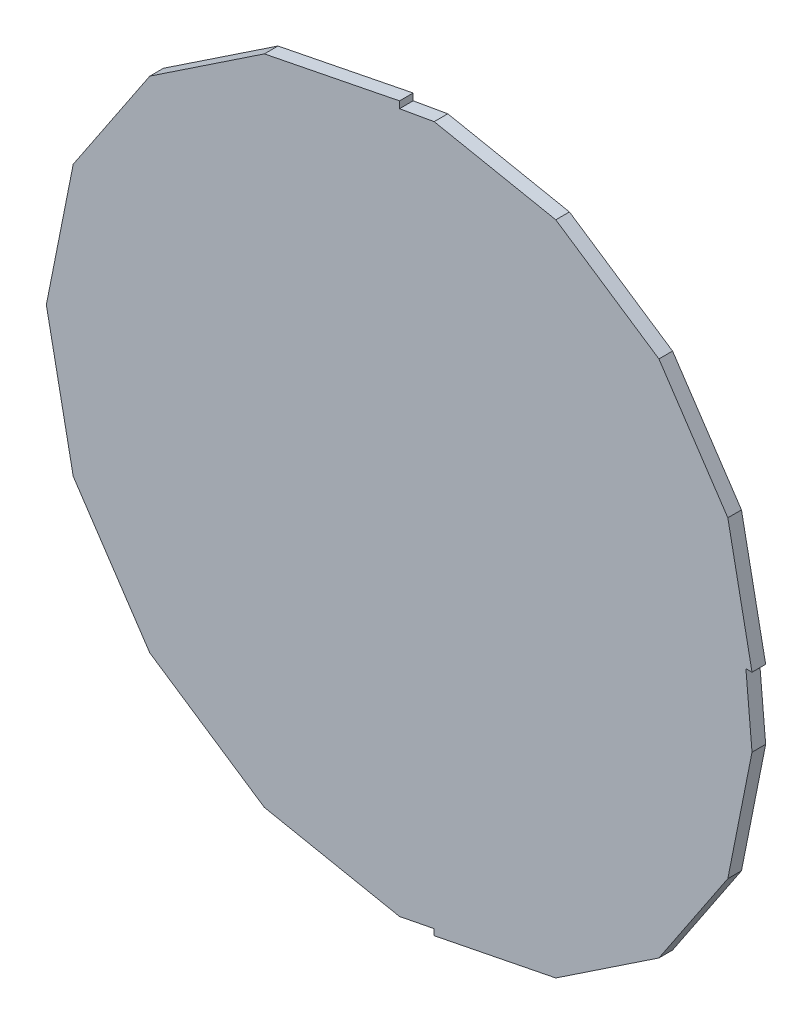
ISO-10303-21;
HEADER;
FILE_DESCRIPTION(('STEP AP214'),'2;1');
FILE_NAME('part.step','',(''),(''),'','','');
FILE_SCHEMA(('AUTOMOTIVE_DESIGN { 1 0 10303 214 1 1 1 1 }'));
ENDSEC;
DATA;
#1=APPLICATION_CONTEXT('core data for automotive mechanical design processes');
#2=APPLICATION_PROTOCOL_DEFINITION('international standard','automotive_design',2000,#1);
#3=PRODUCT_CONTEXT('',#1,'mechanical');
#4=PRODUCT('Part','Part','',(#3));
#5=PRODUCT_RELATED_PRODUCT_CATEGORY('part','',(#4));
#6=PRODUCT_DEFINITION_FORMATION('','',#4);
#7=PRODUCT_DEFINITION_CONTEXT('part definition',#1,'design');
#8=PRODUCT_DEFINITION('design','',#6,#7);
#9=PRODUCT_DEFINITION_SHAPE('','',#8);
#10=(LENGTH_UNIT() NAMED_UNIT(*) SI_UNIT(.MILLI.,.METRE.));
#11=(NAMED_UNIT(*) PLANE_ANGLE_UNIT() SI_UNIT($,.RADIAN.));
#12=(NAMED_UNIT(*) SI_UNIT($,.STERADIAN.) SOLID_ANGLE_UNIT());
#13=UNCERTAINTY_MEASURE_WITH_UNIT(LENGTH_MEASURE(1.E-05),#10,'distance_accuracy_value','');
#14=(GEOMETRIC_REPRESENTATION_CONTEXT(3) GLOBAL_UNCERTAINTY_ASSIGNED_CONTEXT((#13)) GLOBAL_UNIT_ASSIGNED_CONTEXT((#10,
#11,#12)) REPRESENTATION_CONTEXT('',''));
#15=CARTESIAN_POINT('',(0.,0.,0.));
#16=DIRECTION('',(0.,0.,1.));
#17=DIRECTION('',(1.,0.,0.));
#18=AXIS2_PLACEMENT_3D('',#15,#16,#17);
#19=CARTESIAN_POINT('',(0.02564892000001,0.25847802,0.00999998));
#20=DIRECTION('',(0.,0.,1.));
#21=DIRECTION('',(1.,0.,0.));
#22=AXIS2_PLACEMENT_3D('',#19,#20,#21);
#23=PLANE('',#22);
#24=DIRECTION('',(-0.831465458552138,0.555576449496092,0.));
#25=VECTOR('',#24,1.);
#26=CARTESIAN_POINT('',(0.11484356,0.24073612,0.00999998));
#27=LINE('',#26,#25);
#28=CARTESIAN_POINT('',(0.114843559999999,0.240736119999997,0.00999998));
#29=VERTEX_POINT('',#28);
#30=CARTESIAN_POINT('',(0.190459360000007,0.190210440000011,0.00999998));
#31=VERTEX_POINT('',#30);
#32=EDGE_CURVE('E257',#29,#31,#27,.F.);
#33=ORIENTED_EDGE('',*,*,#32,.F.);
#34=DIRECTION('',(-0.980785316171062,0.195090142199012,0.));
#35=VECTOR('',#34,1.);
#36=CARTESIAN_POINT('',(0.02564892000001,0.25847802,0.00999998));
#37=LINE('',#36,#35);
#38=CARTESIAN_POINT('',(0.0256489200000114,0.258478019999992,0.00999998));
#39=VERTEX_POINT('',#38);
#40=EDGE_CURVE('E178',#39,#29,#37,.F.);
#41=ORIENTED_EDGE('',*,*,#40,.F.);
#42=DIRECTION('',(-0.984812296572393,-0.173622407885069,0.));
#43=VECTOR('',#42,1.);
#44=CARTESIAN_POINT('',(0.0002489200000042,0.254,0.00999998));
#45=LINE('',#44,#43);
#46=CARTESIAN_POINT('',(0.0002489200000042,0.254,0.00999998));
#47=VERTEX_POINT('',#46);
#48=EDGE_CURVE('E20',#47,#39,#45,.F.);
#49=ORIENTED_EDGE('',*,*,#48,.F.);
#50=DIRECTION('',(0.,1.,0.));
#51=VECTOR('',#50,1.);
#52=CARTESIAN_POINT('',(0.0002489200000042,0.25897586,0.00999998));
#53=LINE('',#52,#51);
#54=CARTESIAN_POINT('',(0.000248920000002501,0.258975860000009,0.00999998));
#55=VERTEX_POINT('',#54);
#56=EDGE_CURVE('E167',#55,#47,#53,.F.);
#57=ORIENTED_EDGE('',*,*,#56,.F.);
#58=DIRECTION('',(-0.980786063177685,-0.195086386701937,0.));
#59=VECTOR('',#58,1.);
#60=CARTESIAN_POINT('',(-0.09885679999999,0.23926292,0.00999998));
#61=LINE('',#60,#59);
#62=CARTESIAN_POINT('',(-0.0988567999999997,0.239262920000015,0.00999998));
#63=VERTEX_POINT('',#62);
#64=EDGE_CURVE('E162',#63,#55,#61,.F.);
#65=ORIENTED_EDGE('',*,*,#64,.F.);
#66=DIRECTION('',(-0.831469763080059,-0.55557000736504,0.));
#67=VECTOR('',#66,1.);
#68=CARTESIAN_POINT('',(-0.18287492,0.18312384,0.00999998));
#69=LINE('',#68,#67);
#70=CARTESIAN_POINT('',(-0.182874920000017,0.183123840000011,0.00999998));
#71=VERTEX_POINT('',#70);
#72=EDGE_CURVE('E189',#71,#63,#69,.F.);
#73=ORIENTED_EDGE('',*,*,#72,.F.);
#74=DIRECTION('',(-0.555570007363886,-0.83146976308083,0.));
#75=VECTOR('',#74,1.);
#76=CARTESIAN_POINT('',(-0.239014,0.09910572000001,0.00999998));
#77=LINE('',#76,#75);
#78=CARTESIAN_POINT('',(-0.239013999999991,0.0991057200000081,0.00999998));
#79=VERTEX_POINT('',#78);
#80=EDGE_CURVE('E193',#79,#71,#77,.F.);
#81=ORIENTED_EDGE('',*,*,#80,.F.);
#82=DIRECTION('',(-0.195086386701937,-0.980786063177685,0.));
#83=VECTOR('',#82,1.);
#84=CARTESIAN_POINT('',(-0.25872694,0.,0.00999998));
#85=LINE('',#84,#83);
#86=CARTESIAN_POINT('',(-0.258726940000008,0.,0.00999998));
#87=VERTEX_POINT('',#86);
#88=EDGE_CURVE('E197',#87,#79,#85,.F.);
#89=ORIENTED_EDGE('',*,*,#88,.F.);
#90=DIRECTION('',(0.195086386701937,-0.980786063177685,0.));
#91=VECTOR('',#90,1.);
#92=CARTESIAN_POINT('',(-0.239014,-0.09910571999998,0.00999998));
#93=LINE('',#92,#91);
#94=CARTESIAN_POINT('',(-0.239013999999987,-0.099105719999971,0.00999998));
#95=VERTEX_POINT('',#94);
#96=EDGE_CURVE('E201',#95,#87,#93,.F.);
#97=ORIENTED_EDGE('',*,*,#96,.F.);
#98=DIRECTION('',(0.555570007363886,-0.83146976308083,0.));
#99=VECTOR('',#98,1.);
#100=CARTESIAN_POINT('',(-0.18287492,-0.18312384,0.00999998));
#101=LINE('',#100,#99);
#102=CARTESIAN_POINT('',(-0.18287491999999,-0.183123839999986,0.00999998));
#103=VERTEX_POINT('',#102);
#104=EDGE_CURVE('E205',#103,#95,#101,.F.);
#105=ORIENTED_EDGE('',*,*,#104,.F.);
#106=DIRECTION('',(0.831469763080059,-0.55557000736504,0.));
#107=VECTOR('',#106,1.);
#108=CARTESIAN_POINT('',(-0.09885679999999,-0.23926292,0.00999998));
#109=LINE('',#108,#107);
#110=CARTESIAN_POINT('',(-0.0988567999999882,-0.239262919999991,0.00999998));
#111=VERTEX_POINT('',#110);
#112=EDGE_CURVE('E209',#111,#103,#109,.F.);
#113=ORIENTED_EDGE('',*,*,#112,.F.);
#114=DIRECTION('',(0.980786063177685,-0.195086386701937,0.));
#115=VECTOR('',#114,1.);
#116=CARTESIAN_POINT('',(0.0002489200000042,-0.25897586,0.00999998));
#117=LINE('',#116,#115);
#118=CARTESIAN_POINT('',(0.000248920000004808,-0.258975860000003,0.00999998));
#119=VERTEX_POINT('',#118);
#120=EDGE_CURVE('E213',#119,#111,#117,.F.);
#121=ORIENTED_EDGE('',*,*,#120,.F.);
#122=DIRECTION('',(0.981346797966218,0.192245837722043,0.));
#123=VECTOR('',#122,1.);
#124=CARTESIAN_POINT('',(0.02564892000001,-0.254,0.00999998));
#125=LINE('',#124,#123);
#126=CARTESIAN_POINT('',(0.02564892000001,-0.254,0.00999998));
#127=VERTEX_POINT('',#126);
#128=EDGE_CURVE('E217',#127,#119,#125,.F.);
#129=ORIENTED_EDGE('',*,*,#128,.F.);
#130=DIRECTION('',(0.,1.,0.));
#131=VECTOR('',#130,1.);
#132=CARTESIAN_POINT('',(0.02564892000001,-0.25847802,0.00999998));
#133=LINE('',#132,#131);
#134=CARTESIAN_POINT('',(0.0256489200000106,-0.258478020000003,0.00999998));
#135=VERTEX_POINT('',#134);
#136=EDGE_CURVE('E221',#135,#127,#133,.T.);
#137=ORIENTED_EDGE('',*,*,#136,.F.);
#138=DIRECTION('',(0.980785316171062,0.195090142199012,0.));
#139=VECTOR('',#138,1.);
#140=CARTESIAN_POINT('',(0.11484356,-0.24073612,0.00999998));
#141=LINE('',#140,#139);
#142=CARTESIAN_POINT('',(0.114843559999993,-0.240736119999989,0.00999998));
#143=VERTEX_POINT('',#142);
#144=EDGE_CURVE('E225',#143,#135,#141,.F.);
#145=ORIENTED_EDGE('',*,*,#144,.F.);
#146=DIRECTION('',(0.831465458552138,0.555576449496092,0.));
#147=VECTOR('',#146,1.);
#148=CARTESIAN_POINT('',(0.19045936,-0.19021044,0.00999998));
#149=LINE('',#148,#147);
#150=CARTESIAN_POINT('',(0.190459360000011,-0.190210440000007,0.00999998));
#151=VERTEX_POINT('',#150);
#152=EDGE_CURVE('E229',#151,#143,#149,.F.);
#153=ORIENTED_EDGE('',*,*,#152,.F.);
#154=DIRECTION('',(0.555576449496092,0.831465458552138,0.));
#155=VECTOR('',#154,1.);
#156=CARTESIAN_POINT('',(0.24098504,-0.11459464,0.00999998));
#157=LINE('',#156,#155);
#158=CARTESIAN_POINT('',(0.240985039999996,-0.114594639999999,0.00999998));
#159=VERTEX_POINT('',#158);
#160=EDGE_CURVE('E233',#159,#151,#157,.F.);
#161=ORIENTED_EDGE('',*,*,#160,.F.);
#162=DIRECTION('',(0.195090142199012,0.980785316171062,0.));
#163=VECTOR('',#162,1.);
#164=CARTESIAN_POINT('',(0.25872694,-0.02539999999999,0.00999998));
#165=LINE('',#164,#163);
#166=CARTESIAN_POINT('',(0.258726939999998,-0.0253999999999904,0.00999998));
#167=VERTEX_POINT('',#166);
#168=EDGE_CURVE('E237',#167,#159,#165,.F.);
#169=ORIENTED_EDGE('',*,*,#168,.F.);
#170=DIRECTION('',(-0.0878095017098309,0.996137285422783,0.));
#171=VECTOR('',#170,1.);
#172=CARTESIAN_POINT('',(0.25424892,0.02540000000002,0.00999998));
#173=LINE('',#172,#171);
#174=CARTESIAN_POINT('',(0.25424892,0.02540000000002,0.00999998));
#175=VERTEX_POINT('',#174);
#176=EDGE_CURVE('E241',#175,#167,#173,.F.);
#177=ORIENTED_EDGE('',*,*,#176,.F.);
#178=DIRECTION('',(1.,0.,0.));
#179=VECTOR('',#178,1.);
#180=CARTESIAN_POINT('',(0.25872694,0.02540000000002,0.00999998));
#181=LINE('',#180,#179);
#182=CARTESIAN_POINT('',(0.258726940000003,0.0254000000000205,0.00999998));
#183=VERTEX_POINT('',#182);
#184=EDGE_CURVE('E245',#183,#175,#181,.F.);
#185=ORIENTED_EDGE('',*,*,#184,.F.);
#186=DIRECTION('',(-0.195090142199012,0.980785316171062,0.));
#187=VECTOR('',#186,1.);
#188=CARTESIAN_POINT('',(0.24098504,0.11459464,0.00999998));
#189=LINE('',#188,#187);
#190=CARTESIAN_POINT('',(0.240985039999989,0.114594639999993,0.00999998));
#191=VERTEX_POINT('',#190);
#192=EDGE_CURVE('E249',#191,#183,#189,.F.);
#193=ORIENTED_EDGE('',*,*,#192,.F.);
#194=DIRECTION('',(-0.555576449496092,0.831465458552138,0.));
#195=VECTOR('',#194,1.);
#196=CARTESIAN_POINT('',(0.19045936,0.19021044,0.00999998));
#197=LINE('',#196,#195);
#198=EDGE_CURVE('E253',#31,#191,#197,.F.);
#199=ORIENTED_EDGE('',*,*,#198,.F.);
#200=EDGE_LOOP('',(#33,#41,#49,#57,#65,#73,#81,#89,#97,#105,#113,#121,#129,#137,#145,#153,#161,
#169,#177,#185,#193,#199));
#201=FACE_BOUND('',#200,.T.);
#202=ADVANCED_FACE('F17',(#201),#23,.T.);
#203=CARTESIAN_POINT('',(0.0002489200000042,0.254,0.));
#204=DIRECTION('',(-0.173622407885069,0.984812296572393,0.));
#205=DIRECTION('',(-0.984812296572393,-0.173622407885069,0.));
#206=AXIS2_PLACEMENT_3D('',#203,#204,#205);
#207=PLANE('',#206);
#208=DIRECTION('',(0.,0.,1.));
#209=VECTOR('',#208,1.);
#210=CARTESIAN_POINT('',(0.02564892000001,0.25847802,0.));
#211=LINE('',#210,#209);
#212=CARTESIAN_POINT('',(0.0256489200000114,0.258478019999992,0.));
#213=VERTEX_POINT('',#212);
#214=EDGE_CURVE('E261',#213,#39,#211,.T.);
#215=ORIENTED_EDGE('',*,*,#214,.F.);
#216=DIRECTION('',(-0.984812296572289,-0.173622407885655,0.));
#217=VECTOR('',#216,1.);
#218=CARTESIAN_POINT('',(0.02564892000001,0.25847802,0.));
#219=LINE('',#218,#217);
#220=CARTESIAN_POINT('',(0.0002489200000042,0.254,0.));
#221=VERTEX_POINT('',#220);
#222=EDGE_CURVE('E184',#213,#221,#219,.T.);
#223=ORIENTED_EDGE('',*,*,#222,.T.);
#224=DIRECTION('',(0.,0.,-1.));
#225=VECTOR('',#224,1.);
#226=CARTESIAN_POINT('',(0.0002489200000042,0.254,0.));
#227=LINE('',#226,#225);
#228=EDGE_CURVE('E172',#47,#221,#227,.T.);
#229=ORIENTED_EDGE('',*,*,#228,.F.);
#230=ORIENTED_EDGE('',*,*,#48,.T.);
#231=EDGE_LOOP('',(#215,#223,#229,#230));
#232=FACE_BOUND('',#231,.T.);
#233=ADVANCED_FACE('F183',(#232),#207,.T.);
#234=CARTESIAN_POINT('',(0.0002489200000042,0.25897586,0.));
#235=DIRECTION('',(1.,0.,0.));
#236=DIRECTION('',(0.,0.,-1.));
#237=AXIS2_PLACEMENT_3D('',#234,#235,#236);
#238=PLANE('',#237);
#239=ORIENTED_EDGE('',*,*,#228,.T.);
#240=DIRECTION('',(0.,1.,0.));
#241=VECTOR('',#240,1.);
#242=CARTESIAN_POINT('',(0.0002489200000042,0.25847802,0.));
#243=LINE('',#242,#241);
#244=CARTESIAN_POINT('',(0.000248920000002509,0.258975860000009,0.));
#245=VERTEX_POINT('',#244);
#246=EDGE_CURVE('E266',#221,#245,#243,.T.);
#247=ORIENTED_EDGE('',*,*,#246,.T.);
#248=DIRECTION('',(0.,0.,1.));
#249=VECTOR('',#248,1.);
#250=CARTESIAN_POINT('',(0.000248919999997423,0.258975860000034,0.));
#251=LINE('',#250,#249);
#252=EDGE_CURVE('E174',#55,#245,#251,.F.);
#253=ORIENTED_EDGE('',*,*,#252,.F.);
#254=ORIENTED_EDGE('',*,*,#56,.T.);
#255=EDGE_LOOP('',(#239,#247,#253,#254));
#256=FACE_BOUND('',#255,.T.);
#257=ADVANCED_FACE('F169',(#256),#238,.T.);
#258=CARTESIAN_POINT('',(-0.09885679999999,0.23926292,0.));
#259=DIRECTION('',(-0.195086386701937,0.980786063177685,0.));
#260=DIRECTION('',(-0.980786063177685,-0.195086386701937,0.));
#261=AXIS2_PLACEMENT_3D('',#258,#259,#260);
#262=PLANE('',#261);
#263=ORIENTED_EDGE('',*,*,#252,.T.);
#264=DIRECTION('',(-0.980786063177752,-0.195086386701599,0.));
#265=VECTOR('',#264,1.);
#266=CARTESIAN_POINT('',(0.0002489200000042,0.25897586,0.));
#267=LINE('',#266,#265);
#268=CARTESIAN_POINT('',(-0.0988567999999997,0.239262920000015,0.));
#269=VERTEX_POINT('',#268);
#270=EDGE_CURVE('E268',#245,#269,#267,.T.);
#271=ORIENTED_EDGE('',*,*,#270,.T.);
#272=DIRECTION('',(0.,0.,1.));
#273=VECTOR('',#272,1.);
#274=CARTESIAN_POINT('',(-0.0988568000000288,0.239262920000058,0.));
#275=LINE('',#274,#273);
#276=EDGE_CURVE('E191',#63,#269,#275,.F.);
#277=ORIENTED_EDGE('',*,*,#276,.F.);
#278=ORIENTED_EDGE('',*,*,#64,.T.);
#279=EDGE_LOOP('',(#263,#271,#277,#278));
#280=FACE_BOUND('',#279,.T.);
#281=ADVANCED_FACE('F414',(#280),#262,.T.);
#282=CARTESIAN_POINT('',(-0.18287492,0.18312384,0.));
#283=DIRECTION('',(-0.55557000736504,0.831469763080059,0.));
#284=DIRECTION('',(-0.831469763080059,-0.55557000736504,0.));
#285=AXIS2_PLACEMENT_3D('',#282,#283,#284);
#286=PLANE('',#285);
#287=ORIENTED_EDGE('',*,*,#276,.T.);
#288=DIRECTION('',(-0.831469763080443,-0.555570007364465,0.));
#289=VECTOR('',#288,1.);
#290=CARTESIAN_POINT('',(-0.09885679999999,0.23926292,0.));
#291=LINE('',#290,#289);
#292=CARTESIAN_POINT('',(-0.182874920000017,0.183123840000011,0.));
#293=VERTEX_POINT('',#292);
#294=EDGE_CURVE('E271',#269,#293,#291,.T.);
#295=ORIENTED_EDGE('',*,*,#294,.T.);
#296=DIRECTION('',(0.,0.,1.));
#297=VECTOR('',#296,1.);
#298=CARTESIAN_POINT('',(-0.182874920000068,0.183123840000045,0.));
#299=LINE('',#298,#297);
#300=EDGE_CURVE('E195',#71,#293,#299,.F.);
#301=ORIENTED_EDGE('',*,*,#300,.F.);
#302=ORIENTED_EDGE('',*,*,#72,.T.);
#303=EDGE_LOOP('',(#287,#295,#301,#302));
#304=FACE_BOUND('',#303,.T.);
#305=ADVANCED_FACE('F413',(#304),#286,.T.);
#306=CARTESIAN_POINT('',(-0.239014,0.09910572000001,0.));
#307=DIRECTION('',(-0.83146976308083,0.555570007363886,0.));
#308=DIRECTION('',(-0.555570007363886,-0.83146976308083,0.));
#309=AXIS2_PLACEMENT_3D('',#306,#307,#308);
#310=PLANE('',#309);
#311=ORIENTED_EDGE('',*,*,#300,.T.);
#312=DIRECTION('',(-0.555570007364556,-0.831469763080382,0.));
#313=VECTOR('',#312,1.);
#314=CARTESIAN_POINT('',(-0.18287492,0.18312384,0.));
#315=LINE('',#314,#313);
#316=CARTESIAN_POINT('',(-0.239013999999991,0.0991057200000082,0.));
#317=VERTEX_POINT('',#316);
#318=EDGE_CURVE('E274',#293,#317,#315,.T.);
#319=ORIENTED_EDGE('',*,*,#318,.T.);
#320=DIRECTION('',(0.,0.,1.));
#321=VECTOR('',#320,1.);
#322=CARTESIAN_POINT('',(-0.239013999999963,0.0991057200000026,0.));
#323=LINE('',#322,#321);
#324=EDGE_CURVE('E199',#79,#317,#323,.F.);
#325=ORIENTED_EDGE('',*,*,#324,.F.);
#326=ORIENTED_EDGE('',*,*,#80,.T.);
#327=EDGE_LOOP('',(#311,#319,#325,#326));
#328=FACE_BOUND('',#327,.T.);
#329=ADVANCED_FACE('F407',(#328),#310,.T.);
#330=CARTESIAN_POINT('',(-0.25872694,0.,0.));
#331=DIRECTION('',(-0.980786063177685,0.195086386701937,0.));
#332=DIRECTION('',(-0.195086386701937,-0.980786063177685,0.));
#333=AXIS2_PLACEMENT_3D('',#330,#331,#332);
#334=PLANE('',#333);
#335=ORIENTED_EDGE('',*,*,#324,.T.);
#336=DIRECTION('',(-0.195086386701569,-0.980786063177758,0.));
#337=VECTOR('',#336,1.);
#338=CARTESIAN_POINT('',(-0.239014,0.09910572000001,0.));
#339=LINE('',#338,#337);
#340=CARTESIAN_POINT('',(-0.258726940000008,0.,0.));
#341=VERTEX_POINT('',#340);
#342=EDGE_CURVE('E277',#317,#341,#339,.T.);
#343=ORIENTED_EDGE('',*,*,#342,.T.);
#344=DIRECTION('',(0.,0.,1.));
#345=VECTOR('',#344,1.);
#346=CARTESIAN_POINT('',(-0.258726940000031,0.,0.));
#347=LINE('',#346,#345);
#348=EDGE_CURVE('E203',#87,#341,#347,.F.);
#349=ORIENTED_EDGE('',*,*,#348,.F.);
#350=ORIENTED_EDGE('',*,*,#88,.T.);
#351=EDGE_LOOP('',(#335,#343,#349,#350));
#352=FACE_BOUND('',#351,.T.);
#353=ADVANCED_FACE('F403',(#352),#334,.T.);
#354=CARTESIAN_POINT('',(-0.239014,-0.09910571999998,0.));
#355=DIRECTION('',(-0.980786063177685,-0.195086386701937,0.));
#356=DIRECTION('',(0.195086386701937,-0.980786063177685,0.));
#357=AXIS2_PLACEMENT_3D('',#354,#355,#356);
#358=PLANE('',#357);
#359=ORIENTED_EDGE('',*,*,#348,.T.);
#360=DIRECTION('',(0.195086386701626,-0.980786063177747,0.));
#361=VECTOR('',#360,1.);
#362=CARTESIAN_POINT('',(-0.25872694,0.,0.));
#363=LINE('',#362,#361);
#364=CARTESIAN_POINT('',(-0.239013999999987,-0.099105719999971,0.));
#365=VERTEX_POINT('',#364);
#366=EDGE_CURVE('E280',#341,#365,#363,.T.);
#367=ORIENTED_EDGE('',*,*,#366,.T.);
#368=DIRECTION('',(0.,0.,1.));
#369=VECTOR('',#368,1.);
#370=CARTESIAN_POINT('',(-0.239013999999946,-0.099105719999944,0.));
#371=LINE('',#370,#369);
#372=EDGE_CURVE('E207',#95,#365,#371,.F.);
#373=ORIENTED_EDGE('',*,*,#372,.F.);
#374=ORIENTED_EDGE('',*,*,#96,.T.);
#375=EDGE_LOOP('',(#359,#367,#373,#374));
#376=FACE_BOUND('',#375,.T.);
#377=ADVANCED_FACE('F397',(#376),#358,.T.);
#378=CARTESIAN_POINT('',(-0.18287492,-0.18312384,0.));
#379=DIRECTION('',(-0.83146976308083,-0.555570007363886,0.));
#380=DIRECTION('',(0.555570007363886,-0.83146976308083,0.));
#381=AXIS2_PLACEMENT_3D('',#378,#379,#380);
#382=PLANE('',#381);
#383=ORIENTED_EDGE('',*,*,#372,.T.);
#384=DIRECTION('',(0.555570007364419,-0.831469763080474,0.));
#385=VECTOR('',#384,1.);
#386=CARTESIAN_POINT('',(-0.239014,-0.09910571999998,0.));
#387=LINE('',#386,#385);
#388=CARTESIAN_POINT('',(-0.18287491999999,-0.183123839999986,0.));
#389=VERTEX_POINT('',#388);
#390=EDGE_CURVE('E283',#365,#389,#387,.T.);
#391=ORIENTED_EDGE('',*,*,#390,.T.);
#392=DIRECTION('',(0.,0.,1.));
#393=VECTOR('',#392,1.);
#394=CARTESIAN_POINT('',(-0.182874919999961,-0.183123839999942,0.));
#395=LINE('',#394,#393);
#396=EDGE_CURVE('E211',#103,#389,#395,.F.);
#397=ORIENTED_EDGE('',*,*,#396,.F.);
#398=ORIENTED_EDGE('',*,*,#104,.T.);
#399=EDGE_LOOP('',(#383,#391,#397,#398));
#400=FACE_BOUND('',#399,.T.);
#401=ADVANCED_FACE('F393',(#400),#382,.T.);
#402=CARTESIAN_POINT('',(-0.09885679999999,-0.23926292,0.));
#403=DIRECTION('',(-0.55557000736504,-0.831469763080059,0.));
#404=DIRECTION('',(0.831469763080059,-0.55557000736504,0.));
#405=AXIS2_PLACEMENT_3D('',#402,#403,#404);
#406=PLANE('',#405);
#407=ORIENTED_EDGE('',*,*,#396,.T.);
#408=DIRECTION('',(0.831469763080443,-0.555570007364465,0.));
#409=VECTOR('',#408,1.);
#410=CARTESIAN_POINT('',(-0.18287492,-0.18312384,0.));
#411=LINE('',#410,#409);
#412=CARTESIAN_POINT('',(-0.0988567999999883,-0.239262919999991,0.));
#413=VERTEX_POINT('',#412);
#414=EDGE_CURVE('E286',#389,#413,#411,.T.);
#415=ORIENTED_EDGE('',*,*,#414,.T.);
#416=DIRECTION('',(0.,0.,1.));
#417=VECTOR('',#416,1.);
#418=CARTESIAN_POINT('',(-0.0988567999999832,-0.239262919999966,0.));
#419=LINE('',#418,#417);
#420=EDGE_CURVE('E215',#111,#413,#419,.F.);
#421=ORIENTED_EDGE('',*,*,#420,.F.);
#422=ORIENTED_EDGE('',*,*,#112,.T.);
#423=EDGE_LOOP('',(#407,#415,#421,#422));
#424=FACE_BOUND('',#423,.T.);
#425=ADVANCED_FACE('F387',(#424),#406,.T.);
#426=CARTESIAN_POINT('',(0.0002489200000042,-0.25897586,0.));
#427=DIRECTION('',(-0.195086386701937,-0.980786063177685,0.));
#428=DIRECTION('',(0.980786063177685,-0.195086386701937,0.));
#429=AXIS2_PLACEMENT_3D('',#426,#427,#428);
#430=PLANE('',#429);
#431=ORIENTED_EDGE('',*,*,#420,.T.);
#432=DIRECTION('',(0.980786063177752,-0.195086386701599,0.));
#433=VECTOR('',#432,1.);
#434=CARTESIAN_POINT('',(-0.09885679999999,-0.23926292,0.));
#435=LINE('',#434,#433);
#436=CARTESIAN_POINT('',(0.000248920000004812,-0.258975860000003,0.));
#437=VERTEX_POINT('',#436);
#438=EDGE_CURVE('E289',#413,#437,#435,.T.);
#439=ORIENTED_EDGE('',*,*,#438,.T.);
#440=DIRECTION('',(0.,0.,1.));
#441=VECTOR('',#440,1.);
#442=CARTESIAN_POINT('',(0.000248920000006659,-0.258975860000013,0.));
#443=LINE('',#442,#441);
#444=EDGE_CURVE('E219',#119,#437,#443,.F.);
#445=ORIENTED_EDGE('',*,*,#444,.F.);
#446=ORIENTED_EDGE('',*,*,#120,.T.);
#447=EDGE_LOOP('',(#431,#439,#445,#446));
#448=FACE_BOUND('',#447,.T.);
#449=ADVANCED_FACE('F383',(#448),#430,.T.);
#450=CARTESIAN_POINT('',(0.02564892000001,-0.254,0.));
#451=DIRECTION('',(0.192245837722043,-0.981346797966218,0.));
#452=DIRECTION('',(0.981346797966218,0.192245837722043,0.));
#453=AXIS2_PLACEMENT_3D('',#450,#451,#452);
#454=PLANE('',#453);
#455=ORIENTED_EDGE('',*,*,#444,.T.);
#456=DIRECTION('',(0.981346797966313,0.19224583772156,0.));
#457=VECTOR('',#456,1.);
#458=CARTESIAN_POINT('',(0.0002489200000042,-0.25897586,0.));
#459=LINE('',#458,#457);
#460=CARTESIAN_POINT('',(0.02564892000001,-0.254,0.));
#461=VERTEX_POINT('',#460);
#462=EDGE_CURVE('E292',#437,#461,#459,.T.);
#463=ORIENTED_EDGE('',*,*,#462,.T.);
#464=DIRECTION('',(0.,0.,1.));
#465=VECTOR('',#464,1.);
#466=CARTESIAN_POINT('',(0.02564892000001,-0.254,0.));
#467=LINE('',#466,#465);
#468=EDGE_CURVE('E223',#127,#461,#467,.F.);
#469=ORIENTED_EDGE('',*,*,#468,.F.);
#470=ORIENTED_EDGE('',*,*,#128,.T.);
#471=EDGE_LOOP('',(#455,#463,#469,#470));
#472=FACE_BOUND('',#471,.T.);
#473=ADVANCED_FACE('F377',(#472),#454,.T.);
#474=CARTESIAN_POINT('',(0.02564892000001,-0.25847802,0.));
#475=DIRECTION('',(-1.,0.,0.));
#476=DIRECTION('',(0.,0.,1.));
#477=AXIS2_PLACEMENT_3D('',#474,#475,#476);
#478=PLANE('',#477);
#479=ORIENTED_EDGE('',*,*,#468,.T.);
#480=DIRECTION('',(0.,1.,0.));
#481=VECTOR('',#480,1.);
#482=CARTESIAN_POINT('',(0.02564892000001,0.25847802,0.));
#483=LINE('',#482,#481);
#484=CARTESIAN_POINT('',(0.0256489200000106,-0.258478020000003,0.));
#485=VERTEX_POINT('',#484);
#486=EDGE_CURVE('E295',#461,#485,#483,.F.);
#487=ORIENTED_EDGE('',*,*,#486,.T.);
#488=DIRECTION('',(0.,0.,1.));
#489=VECTOR('',#488,1.);
#490=CARTESIAN_POINT('',(0.0256489200000124,-0.258478020000012,0.));
#491=LINE('',#490,#489);
#492=EDGE_CURVE('E227',#135,#485,#491,.F.);
#493=ORIENTED_EDGE('',*,*,#492,.F.);
#494=ORIENTED_EDGE('',*,*,#136,.T.);
#495=EDGE_LOOP('',(#479,#487,#493,#494));
#496=FACE_BOUND('',#495,.T.);
#497=ADVANCED_FACE('F373',(#496),#478,.T.);
#498=CARTESIAN_POINT('',(0.11484356,-0.24073612,0.));
#499=DIRECTION('',(0.195090142199012,-0.980785316171062,0.));
#500=DIRECTION('',(0.980785316171062,0.195090142199012,0.));
#501=AXIS2_PLACEMENT_3D('',#498,#499,#500);
#502=PLANE('',#501);
#503=ORIENTED_EDGE('',*,*,#492,.T.);
#504=DIRECTION('',(0.980785316171088,0.195090142198879,0.));
#505=VECTOR('',#504,1.);
#506=CARTESIAN_POINT('',(0.02564892000001,-0.25847802,0.));
#507=LINE('',#506,#505);
#508=CARTESIAN_POINT('',(0.114843559999993,-0.240736119999989,0.));
#509=VERTEX_POINT('',#508);
#510=EDGE_CURVE('E298',#485,#509,#507,.T.);
#511=ORIENTED_EDGE('',*,*,#510,.T.);
#512=DIRECTION('',(0.,0.,1.));
#513=VECTOR('',#512,1.);
#514=CARTESIAN_POINT('',(0.114843559999971,-0.240736119999957,0.));
#515=LINE('',#514,#513);
#516=EDGE_CURVE('E231',#143,#509,#515,.F.);
#517=ORIENTED_EDGE('',*,*,#516,.F.);
#518=ORIENTED_EDGE('',*,*,#144,.T.);
#519=EDGE_LOOP('',(#503,#511,#517,#518));
#520=FACE_BOUND('',#519,.T.);
#521=ADVANCED_FACE('F367',(#520),#502,.T.);
#522=CARTESIAN_POINT('',(0.19045936,-0.19021044,0.));
#523=DIRECTION('',(0.555576449496092,-0.831465458552138,0.));
#524=DIRECTION('',(0.831465458552138,0.555576449496092,0.));
#525=AXIS2_PLACEMENT_3D('',#522,#523,#524);
#526=PLANE('',#525);
#527=ORIENTED_EDGE('',*,*,#516,.T.);
#528=DIRECTION('',(0.83146545855182,0.555576449496567,0.));
#529=VECTOR('',#528,1.);
#530=CARTESIAN_POINT('',(0.11484356,-0.24073612,0.));
#531=LINE('',#530,#529);
#532=CARTESIAN_POINT('',(0.190459360000011,-0.190210440000007,0.));
#533=VERTEX_POINT('',#532);
#534=EDGE_CURVE('E301',#509,#533,#531,.T.);
#535=ORIENTED_EDGE('',*,*,#534,.T.);
#536=DIRECTION('',(0.,0.,1.));
#537=VECTOR('',#536,1.);
#538=CARTESIAN_POINT('',(0.190459360000043,-0.190210440000029,0.));
#539=LINE('',#538,#537);
#540=EDGE_CURVE('E235',#151,#533,#539,.F.);
#541=ORIENTED_EDGE('',*,*,#540,.F.);
#542=ORIENTED_EDGE('',*,*,#152,.T.);
#543=EDGE_LOOP('',(#527,#535,#541,#542));
#544=FACE_BOUND('',#543,.T.);
#545=ADVANCED_FACE('F363',(#544),#526,.T.);
#546=CARTESIAN_POINT('',(0.24098504,-0.11459464,0.));
#547=DIRECTION('',(0.831465458552138,-0.555576449496092,0.));
#548=DIRECTION('',(0.555576449496092,0.831465458552138,0.));
#549=AXIS2_PLACEMENT_3D('',#546,#547,#548);
#550=PLANE('',#549);
#551=ORIENTED_EDGE('',*,*,#540,.T.);
#552=DIRECTION('',(0.555576449496567,0.83146545855182,0.));
#553=VECTOR('',#552,1.);
#554=CARTESIAN_POINT('',(0.19045936,-0.19021044,0.));
#555=LINE('',#554,#553);
#556=CARTESIAN_POINT('',(0.240985039999996,-0.114594639999999,0.));
#557=VERTEX_POINT('',#556);
#558=EDGE_CURVE('E304',#533,#557,#555,.T.);
#559=ORIENTED_EDGE('',*,*,#558,.T.);
#560=DIRECTION('',(0.,0.,1.));
#561=VECTOR('',#560,1.);
#562=CARTESIAN_POINT('',(0.240985039999984,-0.114594639999997,0.));
#563=LINE('',#562,#561);
#564=EDGE_CURVE('E239',#159,#557,#563,.F.);
#565=ORIENTED_EDGE('',*,*,#564,.F.);
#566=ORIENTED_EDGE('',*,*,#160,.T.);
#567=EDGE_LOOP('',(#551,#559,#565,#566));
#568=FACE_BOUND('',#567,.T.);
#569=ADVANCED_FACE('F357',(#568),#550,.T.);
#570=CARTESIAN_POINT('',(0.25872694,-0.02539999999999,0.));
#571=DIRECTION('',(0.980785316171062,-0.195090142199012,0.));
#572=DIRECTION('',(0.195090142199012,0.980785316171062,0.));
#573=AXIS2_PLACEMENT_3D('',#570,#571,#572);
#574=PLANE('',#573);
#575=ORIENTED_EDGE('',*,*,#564,.T.);
#576=DIRECTION('',(0.195090142198837,0.980785316171097,0.));
#577=VECTOR('',#576,1.);
#578=CARTESIAN_POINT('',(0.24098504,-0.11459464,0.));
#579=LINE('',#578,#577);
#580=CARTESIAN_POINT('',(0.258726939999998,-0.0253999999999903,0.));
#581=VERTEX_POINT('',#580);
#582=EDGE_CURVE('E307',#557,#581,#579,.T.);
#583=ORIENTED_EDGE('',*,*,#582,.T.);
#584=DIRECTION('',(0.,0.,1.));
#585=VECTOR('',#584,1.);
#586=CARTESIAN_POINT('',(0.258726939999991,-0.0253999999999908,0.));
#587=LINE('',#586,#585);
#588=EDGE_CURVE('E243',#167,#581,#587,.F.);
#589=ORIENTED_EDGE('',*,*,#588,.F.);
#590=ORIENTED_EDGE('',*,*,#168,.T.);
#591=EDGE_LOOP('',(#575,#583,#589,#590));
#592=FACE_BOUND('',#591,.T.);
#593=ADVANCED_FACE('F353',(#592),#574,.T.);
#594=CARTESIAN_POINT('',(0.25424892,0.02540000000002,0.));
#595=DIRECTION('',(0.996137285422783,0.0878095017098309,0.));
#596=DIRECTION('',(-0.0878095017098309,0.996137285422783,0.));
#597=AXIS2_PLACEMENT_3D('',#594,#595,#596);
#598=PLANE('',#597);
#599=ORIENTED_EDGE('',*,*,#588,.T.);
#600=DIRECTION('',(-0.0878095017099999,0.996137285422768,0.));
#601=VECTOR('',#600,1.);
#602=CARTESIAN_POINT('',(0.25872694,-0.02539999999999,0.));
#603=LINE('',#602,#601);
#604=CARTESIAN_POINT('',(0.25424892,0.02540000000002,0.));
#605=VERTEX_POINT('',#604);
#606=EDGE_CURVE('E310',#581,#605,#603,.T.);
#607=ORIENTED_EDGE('',*,*,#606,.T.);
#608=DIRECTION('',(0.,0.,-1.));
#609=VECTOR('',#608,1.);
#610=CARTESIAN_POINT('',(0.25424892,0.02540000000002,0.));
#611=LINE('',#610,#609);
#612=EDGE_CURVE('E247',#175,#605,#611,.T.);
#613=ORIENTED_EDGE('',*,*,#612,.F.);
#614=ORIENTED_EDGE('',*,*,#176,.T.);
#615=EDGE_LOOP('',(#599,#607,#613,#614));
#616=FACE_BOUND('',#615,.T.);
#617=ADVANCED_FACE('F347',(#616),#598,.T.);
#618=CARTESIAN_POINT('',(0.25872694,0.02540000000002,0.));
#619=DIRECTION('',(0.,-1.,0.));
#620=DIRECTION('',(0.,0.,-1.));
#621=AXIS2_PLACEMENT_3D('',#618,#619,#620);
#622=PLANE('',#621);
#623=ORIENTED_EDGE('',*,*,#612,.T.);
#624=DIRECTION('',(1.,0.,0.));
#625=VECTOR('',#624,1.);
#626=CARTESIAN_POINT('',(0.02564892000001,0.02540000000002,0.));
#627=LINE('',#626,#625);
#628=CARTESIAN_POINT('',(0.258726940000003,0.0254000000000205,0.));
#629=VERTEX_POINT('',#628);
#630=EDGE_CURVE('E313',#605,#629,#627,.T.);
#631=ORIENTED_EDGE('',*,*,#630,.T.);
#632=DIRECTION('',(0.,0.,1.));
#633=VECTOR('',#632,1.);
#634=CARTESIAN_POINT('',(0.25872694000001,0.025400000000022,0.));
#635=LINE('',#634,#633);
#636=EDGE_CURVE('E251',#183,#629,#635,.F.);
#637=ORIENTED_EDGE('',*,*,#636,.F.);
#638=ORIENTED_EDGE('',*,*,#184,.T.);
#639=EDGE_LOOP('',(#623,#631,#637,#638));
#640=FACE_BOUND('',#639,.T.);
#641=ADVANCED_FACE('F343',(#640),#622,.T.);
#642=CARTESIAN_POINT('',(0.24098504,0.11459464,0.));
#643=DIRECTION('',(0.980785316171062,0.195090142199012,0.));
#644=DIRECTION('',(-0.195090142199012,0.980785316171062,0.));
#645=AXIS2_PLACEMENT_3D('',#642,#643,#644);
#646=PLANE('',#645);
#647=ORIENTED_EDGE('',*,*,#636,.T.);
#648=DIRECTION('',(-0.1950901421989,0.980785316171084,0.));
#649=VECTOR('',#648,1.);
#650=CARTESIAN_POINT('',(0.25872694,0.02540000000002,0.));
#651=LINE('',#650,#649);
#652=CARTESIAN_POINT('',(0.240985039999989,0.114594639999993,0.));
#653=VERTEX_POINT('',#652);
#654=EDGE_CURVE('E316',#629,#653,#651,.T.);
#655=ORIENTED_EDGE('',*,*,#654,.T.);
#656=DIRECTION('',(0.,0.,1.));
#657=VECTOR('',#656,1.);
#658=CARTESIAN_POINT('',(0.240985039999957,0.114594639999971,0.));
#659=LINE('',#658,#657);
#660=EDGE_CURVE('E255',#191,#653,#659,.F.);
#661=ORIENTED_EDGE('',*,*,#660,.F.);
#662=ORIENTED_EDGE('',*,*,#192,.T.);
#663=EDGE_LOOP('',(#647,#655,#661,#662));
#664=FACE_BOUND('',#663,.T.);
#665=ADVANCED_FACE('F337',(#664),#646,.T.);
#666=CARTESIAN_POINT('',(0.19045936,0.19021044,0.));
#667=DIRECTION('',(0.831465458552138,0.555576449496092,0.));
#668=DIRECTION('',(-0.555576449496092,0.831465458552138,0.));
#669=AXIS2_PLACEMENT_3D('',#666,#667,#668);
#670=PLANE('',#669);
#671=ORIENTED_EDGE('',*,*,#660,.T.);
#672=DIRECTION('',(-0.555576449496567,0.83146545855182,0.));
#673=VECTOR('',#672,1.);
#674=CARTESIAN_POINT('',(0.24098504,0.11459464,0.));
#675=LINE('',#674,#673);
#676=CARTESIAN_POINT('',(0.190459360000007,0.190210440000011,0.));
#677=VERTEX_POINT('',#676);
#678=EDGE_CURVE('E319',#653,#677,#675,.T.);
#679=ORIENTED_EDGE('',*,*,#678,.T.);
#680=DIRECTION('',(0.,0.,1.));
#681=VECTOR('',#680,1.);
#682=CARTESIAN_POINT('',(0.190459360000029,0.190210440000043,0.));
#683=LINE('',#682,#681);
#684=EDGE_CURVE('E259',#31,#677,#683,.F.);
#685=ORIENTED_EDGE('',*,*,#684,.F.);
#686=ORIENTED_EDGE('',*,*,#198,.T.);
#687=EDGE_LOOP('',(#671,#679,#685,#686));
#688=FACE_BOUND('',#687,.T.);
#689=ADVANCED_FACE('F332',(#688),#670,.T.);
#690=CARTESIAN_POINT('',(0.11484356,0.24073612,0.));
#691=DIRECTION('',(0.555576449496092,0.831465458552138,0.));
#692=DIRECTION('',(-0.831465458552138,0.555576449496092,0.));
#693=AXIS2_PLACEMENT_3D('',#690,#691,#692);
#694=PLANE('',#693);
#695=ORIENTED_EDGE('',*,*,#684,.T.);
#696=DIRECTION('',(-0.83146545855182,0.555576449496567,0.));
#697=VECTOR('',#696,1.);
#698=CARTESIAN_POINT('',(0.19045936,0.19021044,0.));
#699=LINE('',#698,#697);
#700=CARTESIAN_POINT('',(0.114843559999999,0.240736119999997,0.));
#701=VERTEX_POINT('',#700);
#702=EDGE_CURVE('E26',#677,#701,#699,.T.);
#703=ORIENTED_EDGE('',*,*,#702,.T.);
#704=DIRECTION('',(0.,0.,1.));
#705=VECTOR('',#704,1.);
#706=CARTESIAN_POINT('',(0.114843559999998,0.240736119999988,0.));
#707=LINE('',#706,#705);
#708=EDGE_CURVE('E34',#29,#701,#707,.F.);
#709=ORIENTED_EDGE('',*,*,#708,.F.);
#710=ORIENTED_EDGE('',*,*,#32,.T.);
#711=EDGE_LOOP('',(#695,#703,#709,#710));
#712=FACE_BOUND('',#711,.T.);
#713=ADVANCED_FACE('F325',(#712),#694,.T.);
#714=CARTESIAN_POINT('',(0.02564892000001,0.25847802,0.));
#715=DIRECTION('',(0.195090142199012,0.980785316171062,0.));
#716=DIRECTION('',(-0.980785316171062,0.195090142199012,0.));
#717=AXIS2_PLACEMENT_3D('',#714,#715,#716);
#718=PLANE('',#717);
#719=ORIENTED_EDGE('',*,*,#708,.T.);
#720=DIRECTION('',(-0.980785316171088,0.195090142198879,0.));
#721=VECTOR('',#720,1.);
#722=CARTESIAN_POINT('',(0.11484356,0.24073612,0.));
#723=LINE('',#722,#721);
#724=EDGE_CURVE('E11',#701,#213,#723,.T.);
#725=ORIENTED_EDGE('',*,*,#724,.T.);
#726=ORIENTED_EDGE('',*,*,#214,.T.);
#727=ORIENTED_EDGE('',*,*,#40,.T.);
#728=EDGE_LOOP('',(#719,#725,#726,#727));
#729=FACE_BOUND('',#728,.T.);
#730=ADVANCED_FACE('F415',(#729),#718,.T.);
#731=CARTESIAN_POINT('',(0.02564892000001,0.25847802,0.));
#732=DIRECTION('',(0.,0.,1.));
#733=DIRECTION('',(1.,0.,0.));
#734=AXIS2_PLACEMENT_3D('',#731,#732,#733);
#735=PLANE('',#734);
#736=ORIENTED_EDGE('',*,*,#702,.F.);
#737=ORIENTED_EDGE('',*,*,#678,.F.);
#738=ORIENTED_EDGE('',*,*,#654,.F.);
#739=ORIENTED_EDGE('',*,*,#630,.F.);
#740=ORIENTED_EDGE('',*,*,#606,.F.);
#741=ORIENTED_EDGE('',*,*,#582,.F.);
#742=ORIENTED_EDGE('',*,*,#558,.F.);
#743=ORIENTED_EDGE('',*,*,#534,.F.);
#744=ORIENTED_EDGE('',*,*,#510,.F.);
#745=ORIENTED_EDGE('',*,*,#486,.F.);
#746=ORIENTED_EDGE('',*,*,#462,.F.);
#747=ORIENTED_EDGE('',*,*,#438,.F.);
#748=ORIENTED_EDGE('',*,*,#414,.F.);
#749=ORIENTED_EDGE('',*,*,#390,.F.);
#750=ORIENTED_EDGE('',*,*,#366,.F.);
#751=ORIENTED_EDGE('',*,*,#342,.F.);
#752=ORIENTED_EDGE('',*,*,#318,.F.);
#753=ORIENTED_EDGE('',*,*,#294,.F.);
#754=ORIENTED_EDGE('',*,*,#270,.F.);
#755=ORIENTED_EDGE('',*,*,#246,.F.);
#756=ORIENTED_EDGE('',*,*,#222,.F.);
#757=ORIENTED_EDGE('',*,*,#724,.F.);
#758=EDGE_LOOP('',(#736,#737,#738,#739,#740,#741,#742,#743,#744,#745,#746,#747,#748,#749,#750,
#751,#752,#753,#754,#755,#756,#757));
#759=FACE_BOUND('',#758,.T.);
#760=ADVANCED_FACE('F329',(#759),#735,.F.);
#761=CLOSED_SHELL('',(#202,#233,#257,#281,#305,#329,#353,#377,#401,#425,#449,#473,#497,#521,
#545,#569,#593,#617,#641,#665,#689,#713,#730,#760));
#762=MANIFOLD_SOLID_BREP('B1',#761);
#763=ADVANCED_BREP_SHAPE_REPRESENTATION('',(#18,#762),#14);
#764=SHAPE_DEFINITION_REPRESENTATION(#9,#763);
ENDSEC;
END-ISO-10303-21;
